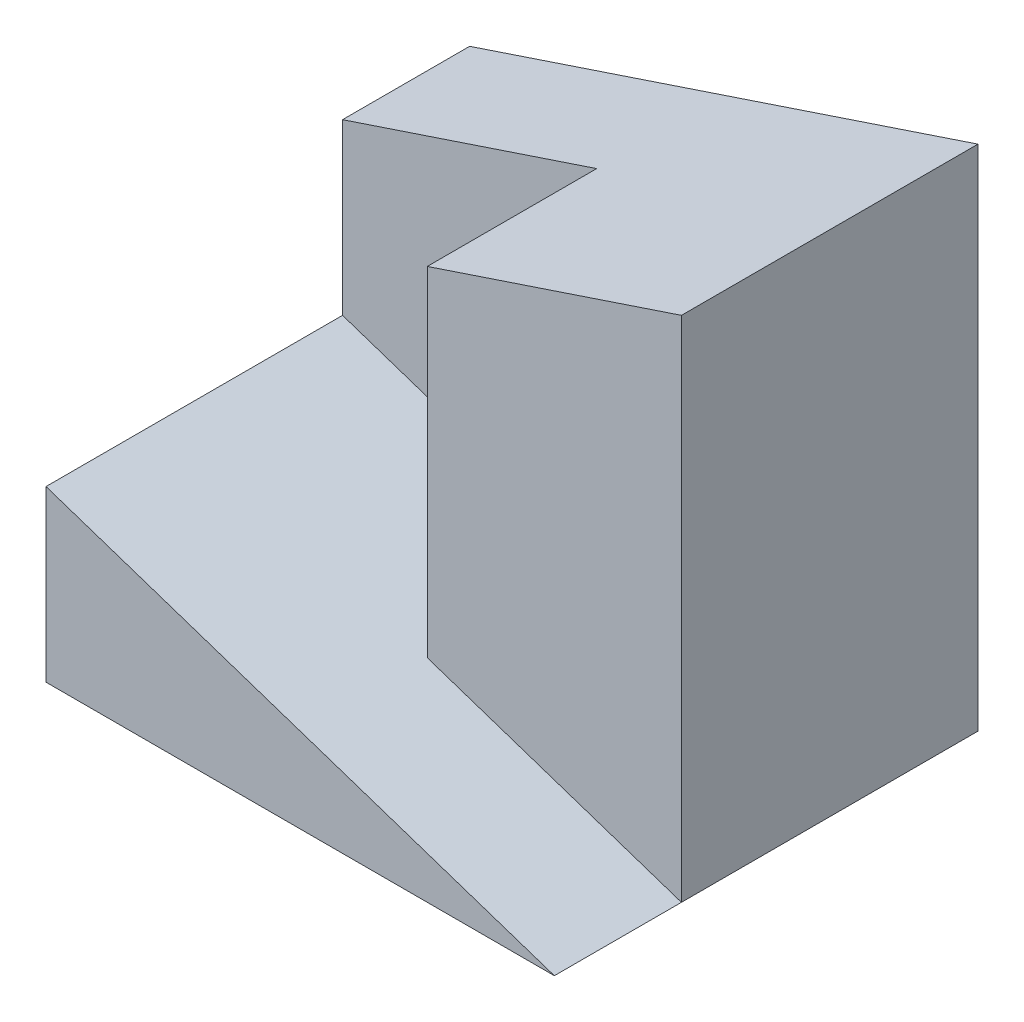
ISO-10303-21;
HEADER;
FILE_DESCRIPTION(('STEP AP214'),'2;1');
FILE_NAME('part.step','',(''),(''),'','','');
FILE_SCHEMA(('AUTOMOTIVE_DESIGN { 1 0 10303 214 1 1 1 1 }'));
ENDSEC;
DATA;
#1=APPLICATION_CONTEXT('core data for automotive mechanical design processes');
#2=APPLICATION_PROTOCOL_DEFINITION('international standard','automotive_design',2000,#1);
#3=PRODUCT_CONTEXT('',#1,'mechanical');
#4=PRODUCT('Part','Part','',(#3));
#5=PRODUCT_RELATED_PRODUCT_CATEGORY('part','',(#4));
#6=PRODUCT_DEFINITION_FORMATION('','',#4);
#7=PRODUCT_DEFINITION_CONTEXT('part definition',#1,'design');
#8=PRODUCT_DEFINITION('design','',#6,#7);
#9=PRODUCT_DEFINITION_SHAPE('','',#8);
#10=(LENGTH_UNIT() NAMED_UNIT(*) SI_UNIT(.MILLI.,.METRE.));
#11=(NAMED_UNIT(*) PLANE_ANGLE_UNIT() SI_UNIT($,.RADIAN.));
#12=(NAMED_UNIT(*) SI_UNIT($,.STERADIAN.) SOLID_ANGLE_UNIT());
#13=UNCERTAINTY_MEASURE_WITH_UNIT(LENGTH_MEASURE(1.E-05),#10,'distance_accuracy_value','');
#14=(GEOMETRIC_REPRESENTATION_CONTEXT(3) GLOBAL_UNCERTAINTY_ASSIGNED_CONTEXT((#13)) GLOBAL_UNIT_ASSIGNED_CONTEXT((#10,
#11,#12)) REPRESENTATION_CONTEXT('',''));
#15=CARTESIAN_POINT('',(0.,0.,0.));
#16=DIRECTION('',(0.,0.,1.));
#17=DIRECTION('',(1.,0.,0.));
#18=AXIS2_PLACEMENT_3D('',#15,#16,#17);
#19=CARTESIAN_POINT('',(-3.,6.,2.5));
#20=DIRECTION('',(0.,0.,-1.));
#21=DIRECTION('',(-1.,0.,0.));
#22=AXIS2_PLACEMENT_3D('',#19,#20,#21);
#23=PLANE('',#22);
#24=DIRECTION('',(1.,0.,0.));
#25=VECTOR('',#24,1.);
#26=CARTESIAN_POINT('',(-3.,0.,2.5));
#27=LINE('',#26,#25);
#28=CARTESIAN_POINT('',(-3.,0.,2.5));
#29=VERTEX_POINT('',#28);
#30=CARTESIAN_POINT('',(3.,0.,2.5));
#31=VERTEX_POINT('',#30);
#32=EDGE_CURVE('E108',#29,#31,#27,.T.);
#33=ORIENTED_EDGE('',*,*,#32,.T.);
#34=DIRECTION('',(0.948683298050514,-0.316227766016838,0.));
#35=VECTOR('',#34,1.);
#36=CARTESIAN_POINT('',(0.3,0.9,2.5));
#37=LINE('',#36,#35);
#38=CARTESIAN_POINT('',(-3.,2.,2.5));
#39=VERTEX_POINT('',#38);
#40=EDGE_CURVE('E103',#39,#31,#37,.T.);
#41=ORIENTED_EDGE('',*,*,#40,.F.);
#42=DIRECTION('',(0.,-1.,0.));
#43=VECTOR('',#42,1.);
#44=CARTESIAN_POINT('',(-3.,6.,2.5));
#45=LINE('',#44,#43);
#46=EDGE_CURVE('E107',#39,#29,#45,.T.);
#47=ORIENTED_EDGE('',*,*,#46,.T.);
#48=EDGE_LOOP('',(#33,#41,#47));
#49=FACE_BOUND('',#48,.T.);
#50=ADVANCED_FACE('F33',(#49),#23,.F.);
#51=CARTESIAN_POINT('',(3.,6.,2.5));
#52=DIRECTION('',(-1.,0.,0.));
#53=DIRECTION('',(0.,0.,1.));
#54=AXIS2_PLACEMENT_3D('',#51,#52,#53);
#55=PLANE('',#54);
#56=DIRECTION('',(0.,0.,-1.));
#57=VECTOR('',#56,1.);
#58=CARTESIAN_POINT('',(3.,6.,2.5));
#59=LINE('',#58,#57);
#60=CARTESIAN_POINT('',(3.,6.,1.));
#61=VERTEX_POINT('',#60);
#62=CARTESIAN_POINT('',(3.,6.,-2.5));
#63=VERTEX_POINT('',#62);
#64=EDGE_CURVE('E95',#61,#63,#59,.T.);
#65=ORIENTED_EDGE('',*,*,#64,.F.);
#66=DIRECTION('',(0.,1.,0.));
#67=VECTOR('',#66,1.);
#68=CARTESIAN_POINT('',(3.,0.,1.));
#69=LINE('',#68,#67);
#70=CARTESIAN_POINT('',(3.,0.,1.));
#71=VERTEX_POINT('',#70);
#72=EDGE_CURVE('E98',#71,#61,#69,.T.);
#73=ORIENTED_EDGE('',*,*,#72,.F.);
#74=DIRECTION('',(0.,0.,-1.));
#75=VECTOR('',#74,1.);
#76=CARTESIAN_POINT('',(3.,0.,2.5));
#77=LINE('',#76,#75);
#78=CARTESIAN_POINT('',(3.,0.,-2.5));
#79=VERTEX_POINT('',#78);
#80=EDGE_CURVE('E122',#71,#79,#77,.T.);
#81=ORIENTED_EDGE('',*,*,#80,.T.);
#82=DIRECTION('',(0.,-1.,0.));
#83=VECTOR('',#82,1.);
#84=CARTESIAN_POINT('',(3.,6.,-2.5));
#85=LINE('',#84,#83);
#86=EDGE_CURVE('E41',#63,#79,#85,.T.);
#87=ORIENTED_EDGE('',*,*,#86,.F.);
#88=EDGE_LOOP('',(#65,#73,#81,#87));
#89=FACE_BOUND('',#88,.T.);
#90=ADVANCED_FACE('F35',(#89),#55,.F.);
#91=CARTESIAN_POINT('',(-3.,6.,-2.5));
#92=DIRECTION('',(0.,0.,1.));
#93=DIRECTION('',(1.,0.,0.));
#94=AXIS2_PLACEMENT_3D('',#91,#92,#93);
#95=PLANE('',#94);
#96=DIRECTION('',(0.,-1.,0.));
#97=VECTOR('',#96,1.);
#98=CARTESIAN_POINT('',(-3.,6.,-2.5));
#99=LINE('',#98,#97);
#100=CARTESIAN_POINT('',(-3.,4.,-2.5));
#101=VERTEX_POINT('',#100);
#102=CARTESIAN_POINT('',(-3.,0.,-2.5));
#103=VERTEX_POINT('',#102);
#104=EDGE_CURVE('E110',#101,#103,#99,.T.);
#105=ORIENTED_EDGE('',*,*,#104,.F.);
#106=DIRECTION('',(0.948683298050514,0.316227766016838,0.));
#107=VECTOR('',#106,1.);
#108=CARTESIAN_POINT('',(-2.4,4.2,-2.5));
#109=LINE('',#108,#107);
#110=EDGE_CURVE('E132',#101,#63,#109,.T.);
#111=ORIENTED_EDGE('',*,*,#110,.T.);
#112=ORIENTED_EDGE('',*,*,#86,.T.);
#113=DIRECTION('',(-1.,0.,0.));
#114=VECTOR('',#113,1.);
#115=CARTESIAN_POINT('',(-3.,0.,-2.5));
#116=LINE('',#115,#114);
#117=EDGE_CURVE('E121',#79,#103,#116,.T.);
#118=ORIENTED_EDGE('',*,*,#117,.T.);
#119=EDGE_LOOP('',(#105,#111,#112,#118));
#120=FACE_BOUND('',#119,.T.);
#121=ADVANCED_FACE('F129',(#120),#95,.F.);
#122=CARTESIAN_POINT('',(-3.,6.,2.5));
#123=DIRECTION('',(1.,0.,0.));
#124=DIRECTION('',(0.,0.,-1.));
#125=AXIS2_PLACEMENT_3D('',#122,#123,#124);
#126=PLANE('',#125);
#127=DIRECTION('',(0.,-1.,0.));
#128=VECTOR('',#127,1.);
#129=CARTESIAN_POINT('',(-3.,0.,-1.));
#130=LINE('',#129,#128);
#131=CARTESIAN_POINT('',(-3.,4.,-1.));
#132=VERTEX_POINT('',#131);
#133=CARTESIAN_POINT('',(-3.,2.,-1.));
#134=VERTEX_POINT('',#133);
#135=EDGE_CURVE('E143',#132,#134,#130,.T.);
#136=ORIENTED_EDGE('',*,*,#135,.F.);
#137=DIRECTION('',(0.,0.,1.));
#138=VECTOR('',#137,1.);
#139=CARTESIAN_POINT('',(-3.,4.,-10.5));
#140=LINE('',#139,#138);
#141=EDGE_CURVE('E170',#101,#132,#140,.T.);
#142=ORIENTED_EDGE('',*,*,#141,.F.);
#143=ORIENTED_EDGE('',*,*,#104,.T.);
#144=DIRECTION('',(0.,0.,1.));
#145=VECTOR('',#144,1.);
#146=CARTESIAN_POINT('',(-3.,0.,2.5));
#147=LINE('',#146,#145);
#148=EDGE_CURVE('E113',#103,#29,#147,.T.);
#149=ORIENTED_EDGE('',*,*,#148,.T.);
#150=ORIENTED_EDGE('',*,*,#46,.F.);
#151=DIRECTION('',(0.,0.,1.));
#152=VECTOR('',#151,1.);
#153=CARTESIAN_POINT('',(-3.,2.,-1.));
#154=LINE('',#153,#152);
#155=EDGE_CURVE('E117',#134,#39,#154,.T.);
#156=ORIENTED_EDGE('',*,*,#155,.F.);
#157=EDGE_LOOP('',(#136,#142,#143,#149,#150,#156));
#158=FACE_BOUND('',#157,.T.);
#159=ADVANCED_FACE('F163',(#158),#126,.F.);
#160=CARTESIAN_POINT('',(0.,0.,0.));
#161=DIRECTION('',(0.,-1.,0.));
#162=DIRECTION('',(0.,0.,-1.));
#163=AXIS2_PLACEMENT_3D('',#160,#161,#162);
#164=PLANE('',#163);
#165=EDGE_CURVE('E119',#31,#71,#77,.T.);
#166=ORIENTED_EDGE('',*,*,#165,.F.);
#167=ORIENTED_EDGE('',*,*,#32,.F.);
#168=ORIENTED_EDGE('',*,*,#148,.F.);
#169=ORIENTED_EDGE('',*,*,#117,.F.);
#170=ORIENTED_EDGE('',*,*,#80,.F.);
#171=EDGE_LOOP('',(#166,#167,#168,#169,#170));
#172=FACE_BOUND('',#171,.T.);
#173=ADVANCED_FACE('F165',(#172),#164,.T.);
#174=CARTESIAN_POINT('',(0.,0.,-1.));
#175=DIRECTION('',(-1.,0.,0.));
#176=DIRECTION('',(0.,-1.,0.));
#177=AXIS2_PLACEMENT_3D('',#174,#175,#176);
#178=PLANE('',#177);
#179=DIRECTION('',(0.,0.,1.));
#180=VECTOR('',#179,1.);
#181=CARTESIAN_POINT('',(0.,5.,-1.));
#182=LINE('',#181,#180);
#183=CARTESIAN_POINT('',(0.,5.,-1.));
#184=VERTEX_POINT('',#183);
#185=CARTESIAN_POINT('',(0.,5.,1.));
#186=VERTEX_POINT('',#185);
#187=EDGE_CURVE('E48',#184,#186,#182,.T.);
#188=ORIENTED_EDGE('',*,*,#187,.F.);
#189=DIRECTION('',(0.,-1.,0.));
#190=VECTOR('',#189,1.);
#191=CARTESIAN_POINT('',(0.,0.,-1.));
#192=LINE('',#191,#190);
#193=CARTESIAN_POINT('',(0.,1.,-1.));
#194=VERTEX_POINT('',#193);
#195=EDGE_CURVE('E141',#184,#194,#192,.T.);
#196=ORIENTED_EDGE('',*,*,#195,.T.);
#197=DIRECTION('',(0.,0.,1.));
#198=VECTOR('',#197,1.);
#199=CARTESIAN_POINT('',(0.,1.,-1.));
#200=LINE('',#199,#198);
#201=CARTESIAN_POINT('',(0.,1.,1.));
#202=VERTEX_POINT('',#201);
#203=EDGE_CURVE('E148',#194,#202,#200,.T.);
#204=ORIENTED_EDGE('',*,*,#203,.T.);
#205=DIRECTION('',(0.,-1.,0.));
#206=VECTOR('',#205,1.);
#207=CARTESIAN_POINT('',(0.,6.,1.));
#208=LINE('',#207,#206);
#209=EDGE_CURVE('E54',#186,#202,#208,.T.);
#210=ORIENTED_EDGE('',*,*,#209,.F.);
#211=EDGE_LOOP('',(#188,#196,#204,#210));
#212=FACE_BOUND('',#211,.T.);
#213=ADVANCED_FACE('F172',(#212),#178,.T.);
#214=CARTESIAN_POINT('',(0.3,0.9,-1.));
#215=DIRECTION('',(-0.316227766016838,-0.948683298050514,0.));
#216=DIRECTION('',(0.948683298050514,-0.316227766016838,0.));
#217=AXIS2_PLACEMENT_3D('',#214,#215,#216);
#218=PLANE('',#217);
#219=ORIENTED_EDGE('',*,*,#40,.T.);
#220=ORIENTED_EDGE('',*,*,#165,.T.);
#221=DIRECTION('',(0.948683298050514,-0.316227766016838,0.));
#222=VECTOR('',#221,1.);
#223=CARTESIAN_POINT('',(0.,1.,1.));
#224=LINE('',#223,#222);
#225=EDGE_CURVE('E100',#202,#71,#224,.T.);
#226=ORIENTED_EDGE('',*,*,#225,.F.);
#227=ORIENTED_EDGE('',*,*,#203,.F.);
#228=DIRECTION('',(0.948683298050514,-0.316227766016838,0.));
#229=VECTOR('',#228,1.);
#230=CARTESIAN_POINT('',(0.3,0.9,-1.));
#231=LINE('',#230,#229);
#232=EDGE_CURVE('E145',#134,#194,#231,.T.);
#233=ORIENTED_EDGE('',*,*,#232,.F.);
#234=ORIENTED_EDGE('',*,*,#155,.T.);
#235=EDGE_LOOP('',(#219,#220,#226,#227,#233,#234));
#236=FACE_BOUND('',#235,.T.);
#237=ADVANCED_FACE('F156',(#236),#218,.F.);
#238=CARTESIAN_POINT('',(0.,0.,-1.));
#239=DIRECTION('',(0.,0.,1.));
#240=DIRECTION('',(1.,0.,0.));
#241=AXIS2_PLACEMENT_3D('',#238,#239,#240);
#242=PLANE('',#241);
#243=DIRECTION('',(0.948683298050514,0.316227766016838,0.));
#244=VECTOR('',#243,1.);
#245=CARTESIAN_POINT('',(-1.5,4.5,-1.));
#246=LINE('',#245,#244);
#247=EDGE_CURVE('E136',#132,#184,#246,.T.);
#248=ORIENTED_EDGE('',*,*,#247,.F.);
#249=ORIENTED_EDGE('',*,*,#135,.T.);
#250=ORIENTED_EDGE('',*,*,#232,.T.);
#251=ORIENTED_EDGE('',*,*,#195,.F.);
#252=EDGE_LOOP('',(#248,#249,#250,#251));
#253=FACE_BOUND('',#252,.T.);
#254=ADVANCED_FACE('F169',(#253),#242,.T.);
#255=CARTESIAN_POINT('',(0.,0.,1.));
#256=DIRECTION('',(0.,0.,-1.));
#257=DIRECTION('',(-1.,0.,0.));
#258=AXIS2_PLACEMENT_3D('',#255,#256,#257);
#259=PLANE('',#258);
#260=ORIENTED_EDGE('',*,*,#72,.T.);
#261=DIRECTION('',(-0.948683298050514,-0.316227766016838,0.));
#262=VECTOR('',#261,1.);
#263=CARTESIAN_POINT('',(-1.5,4.5,1.));
#264=LINE('',#263,#262);
#265=EDGE_CURVE('E11',#61,#186,#264,.T.);
#266=ORIENTED_EDGE('',*,*,#265,.T.);
#267=ORIENTED_EDGE('',*,*,#209,.T.);
#268=ORIENTED_EDGE('',*,*,#225,.T.);
#269=EDGE_LOOP('',(#260,#266,#267,#268));
#270=FACE_BOUND('',#269,.T.);
#271=ADVANCED_FACE('F99',(#270),#259,.F.);
#272=CARTESIAN_POINT('',(3.,6.,-10.5));
#273=DIRECTION('',(0.316227766016838,-0.948683298050514,0.));
#274=DIRECTION('',(0.948683298050514,0.316227766016838,0.));
#275=AXIS2_PLACEMENT_3D('',#272,#273,#274);
#276=PLANE('',#275);
#277=ORIENTED_EDGE('',*,*,#141,.T.);
#278=ORIENTED_EDGE('',*,*,#247,.T.);
#279=ORIENTED_EDGE('',*,*,#187,.T.);
#280=ORIENTED_EDGE('',*,*,#265,.F.);
#281=ORIENTED_EDGE('',*,*,#64,.T.);
#282=ORIENTED_EDGE('',*,*,#110,.F.);
#283=EDGE_LOOP('',(#277,#278,#279,#280,#281,#282));
#284=FACE_BOUND('',#283,.T.);
#285=ADVANCED_FACE('F93',(#284),#276,.F.);
#286=CLOSED_SHELL('',(#50,#90,#121,#159,#173,#213,#237,#254,#271,#285));
#287=MANIFOLD_SOLID_BREP('B2',#286);
#288=ADVANCED_BREP_SHAPE_REPRESENTATION('',(#18,#287),#14);
#289=SHAPE_DEFINITION_REPRESENTATION(#9,#288);
ENDSEC;
END-ISO-10303-21;
